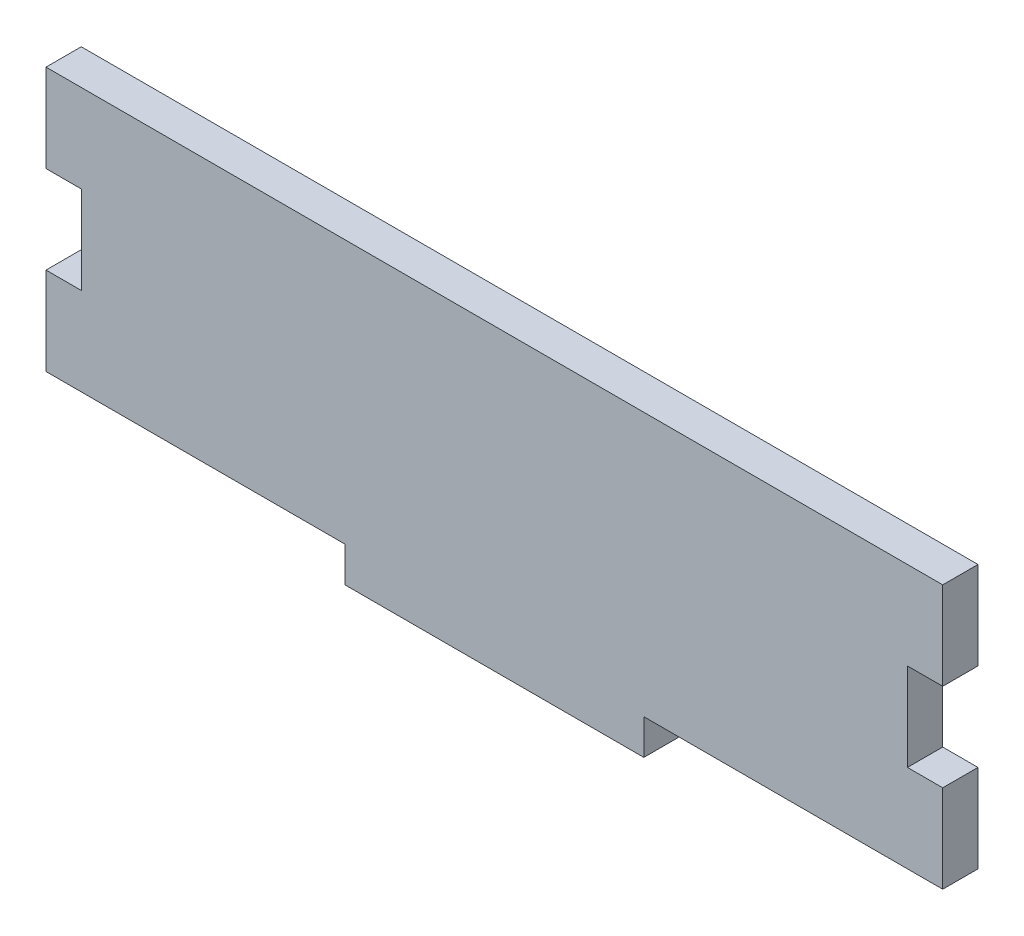
ISO-10303-21;
HEADER;
FILE_DESCRIPTION(('STEP AP214'),'2;1');
FILE_NAME('part.step','',(''),(''),'','','');
FILE_SCHEMA(('AUTOMOTIVE_DESIGN { 1 0 10303 214 1 1 1 1 }'));
ENDSEC;
DATA;
#1=APPLICATION_CONTEXT('core data for automotive mechanical design processes');
#2=APPLICATION_PROTOCOL_DEFINITION('international standard','automotive_design',2000,#1);
#3=PRODUCT_CONTEXT('',#1,'mechanical');
#4=PRODUCT('Part','Part','',(#3));
#5=PRODUCT_RELATED_PRODUCT_CATEGORY('part','',(#4));
#6=PRODUCT_DEFINITION_FORMATION('','',#4);
#7=PRODUCT_DEFINITION_CONTEXT('part definition',#1,'design');
#8=PRODUCT_DEFINITION('design','',#6,#7);
#9=PRODUCT_DEFINITION_SHAPE('','',#8);
#10=(LENGTH_UNIT() NAMED_UNIT(*) SI_UNIT(.MILLI.,.METRE.));
#11=(NAMED_UNIT(*) PLANE_ANGLE_UNIT() SI_UNIT($,.RADIAN.));
#12=(NAMED_UNIT(*) SI_UNIT($,.STERADIAN.) SOLID_ANGLE_UNIT());
#13=UNCERTAINTY_MEASURE_WITH_UNIT(LENGTH_MEASURE(1.E-05),#10,'distance_accuracy_value','');
#14=(GEOMETRIC_REPRESENTATION_CONTEXT(3) GLOBAL_UNCERTAINTY_ASSIGNED_CONTEXT((#13)) GLOBAL_UNIT_ASSIGNED_CONTEXT((#10,
#11,#12)) REPRESENTATION_CONTEXT('',''));
#15=CARTESIAN_POINT('',(0.,0.,0.));
#16=DIRECTION('',(0.,0.,1.));
#17=DIRECTION('',(1.,0.,0.));
#18=AXIS2_PLACEMENT_3D('',#15,#16,#17);
#19=CARTESIAN_POINT('',(-13.6707944709191,19.8635648334526,2.9972));
#20=DIRECTION('',(1.,0.,0.));
#21=DIRECTION('',(0.,0.,-1.));
#22=AXIS2_PLACEMENT_3D('',#19,#20,#21);
#23=PLANE('',#22);
#24=DIRECTION('',(0.,-1.,0.));
#25=VECTOR('',#24,1.);
#26=CARTESIAN_POINT('',(-13.6707944709191,19.8635648334526,0.));
#27=LINE('',#26,#25);
#28=CARTESIAN_POINT('',(-13.6707944709191,27.3311648334526,0.));
#29=VERTEX_POINT('',#28);
#30=CARTESIAN_POINT('',(-13.6707944709191,19.8635648334526,0.));
#31=VERTEX_POINT('',#30);
#32=EDGE_CURVE('E176',#29,#31,#27,.T.);
#33=ORIENTED_EDGE('',*,*,#32,.T.);
#34=DIRECTION('',(0.,0.,-1.));
#35=VECTOR('',#34,1.);
#36=CARTESIAN_POINT('',(-13.6707944709191,19.8635648334526,2.9972));
#37=LINE('',#36,#35);
#38=CARTESIAN_POINT('',(-13.6707944709191,19.8635648334526,2.9972));
#39=VERTEX_POINT('',#38);
#40=EDGE_CURVE('E40',#39,#31,#37,.T.);
#41=ORIENTED_EDGE('',*,*,#40,.F.);
#42=DIRECTION('',(0.,-1.,0.));
#43=VECTOR('',#42,1.);
#44=CARTESIAN_POINT('',(-13.6707944709191,19.8635648334526,2.9972));
#45=LINE('',#44,#43);
#46=CARTESIAN_POINT('',(-13.6707944709191,27.3311648334526,2.9972));
#47=VERTEX_POINT('',#46);
#48=EDGE_CURVE('E293',#47,#39,#45,.T.);
#49=ORIENTED_EDGE('',*,*,#48,.F.);
#50=DIRECTION('',(0.,0.,-1.));
#51=VECTOR('',#50,1.);
#52=CARTESIAN_POINT('',(-13.6707944709191,27.3311648334526,2.9972));
#53=LINE('',#52,#51);
#54=EDGE_CURVE('E11',#47,#29,#53,.T.);
#55=ORIENTED_EDGE('',*,*,#54,.T.);
#56=EDGE_LOOP('',(#33,#41,#49,#55));
#57=FACE_BOUND('',#56,.T.);
#58=ADVANCED_FACE('F32',(#57),#23,.F.);
#59=CARTESIAN_POINT('',(-13.6707944709191,19.8635648334526,2.9972));
#60=DIRECTION('',(0.,1.,0.));
#61=DIRECTION('',(0.,0.,1.));
#62=AXIS2_PLACEMENT_3D('',#59,#60,#61);
#63=PLANE('',#62);
#64=DIRECTION('',(1.,0.,0.));
#65=VECTOR('',#64,1.);
#66=CARTESIAN_POINT('',(-13.6707944709191,19.8635648334526,0.));
#67=LINE('',#66,#65);
#68=CARTESIAN_POINT('',(-10.6735944709191,19.8635648334526,0.));
#69=VERTEX_POINT('',#68);
#70=EDGE_CURVE('E178',#31,#69,#67,.T.);
#71=ORIENTED_EDGE('',*,*,#70,.T.);
#72=DIRECTION('',(0.,0.,-1.));
#73=VECTOR('',#72,1.);
#74=CARTESIAN_POINT('',(-10.6735944709191,19.8635648334526,2.9972));
#75=LINE('',#74,#73);
#76=CARTESIAN_POINT('',(-10.6735944709191,19.8635648334526,2.9972));
#77=VERTEX_POINT('',#76);
#78=EDGE_CURVE('E235',#77,#69,#75,.T.);
#79=ORIENTED_EDGE('',*,*,#78,.F.);
#80=DIRECTION('',(1.,0.,0.));
#81=VECTOR('',#80,1.);
#82=CARTESIAN_POINT('',(-13.6707944709191,19.8635648334526,2.9972));
#83=LINE('',#82,#81);
#84=EDGE_CURVE('E244',#39,#77,#83,.T.);
#85=ORIENTED_EDGE('',*,*,#84,.F.);
#86=ORIENTED_EDGE('',*,*,#40,.T.);
#87=EDGE_LOOP('',(#71,#79,#85,#86));
#88=FACE_BOUND('',#87,.T.);
#89=ADVANCED_FACE('F242',(#88),#63,.F.);
#90=CARTESIAN_POINT('',(-10.6735944709191,19.8635648334526,2.9972));
#91=DIRECTION('',(1.,0.,0.));
#92=DIRECTION('',(0.,0.,-1.));
#93=AXIS2_PLACEMENT_3D('',#90,#91,#92);
#94=PLANE('',#93);
#95=DIRECTION('',(0.,-1.,0.));
#96=VECTOR('',#95,1.);
#97=CARTESIAN_POINT('',(-10.6735944709191,19.8635648334526,0.));
#98=LINE('',#97,#96);
#99=CARTESIAN_POINT('',(-10.6735944709191,12.3959648334526,0.));
#100=VERTEX_POINT('',#99);
#101=EDGE_CURVE('E180',#69,#100,#98,.T.);
#102=ORIENTED_EDGE('',*,*,#101,.T.);
#103=DIRECTION('',(0.,0.,-1.));
#104=VECTOR('',#103,1.);
#105=CARTESIAN_POINT('',(-10.6735944709191,12.3959648334526,2.9972));
#106=LINE('',#105,#104);
#107=CARTESIAN_POINT('',(-10.6735944709191,12.3959648334526,2.9972));
#108=VERTEX_POINT('',#107);
#109=EDGE_CURVE('E232',#108,#100,#106,.T.);
#110=ORIENTED_EDGE('',*,*,#109,.F.);
#111=DIRECTION('',(0.,-1.,0.));
#112=VECTOR('',#111,1.);
#113=CARTESIAN_POINT('',(-10.6735944709191,19.8635648334526,2.9972));
#114=LINE('',#113,#112);
#115=EDGE_CURVE('E265',#77,#108,#114,.T.);
#116=ORIENTED_EDGE('',*,*,#115,.F.);
#117=ORIENTED_EDGE('',*,*,#78,.T.);
#118=EDGE_LOOP('',(#102,#110,#116,#117));
#119=FACE_BOUND('',#118,.T.);
#120=ADVANCED_FACE('F256',(#119),#94,.F.);
#121=CARTESIAN_POINT('',(-13.6707944709191,12.3959648334526,2.9972));
#122=DIRECTION('',(0.,-1.,0.));
#123=DIRECTION('',(0.,0.,-1.));
#124=AXIS2_PLACEMENT_3D('',#121,#122,#123);
#125=PLANE('',#124);
#126=DIRECTION('',(-1.,0.,0.));
#127=VECTOR('',#126,1.);
#128=CARTESIAN_POINT('',(-13.6707944709191,12.3959648334526,0.));
#129=LINE('',#128,#127);
#130=CARTESIAN_POINT('',(-13.6707944709191,12.3959648334526,0.));
#131=VERTEX_POINT('',#130);
#132=EDGE_CURVE('E182',#100,#131,#129,.T.);
#133=ORIENTED_EDGE('',*,*,#132,.T.);
#134=DIRECTION('',(0.,0.,-1.));
#135=VECTOR('',#134,1.);
#136=CARTESIAN_POINT('',(-13.6707944709191,12.3959648334526,2.9972));
#137=LINE('',#136,#135);
#138=CARTESIAN_POINT('',(-13.6707944709191,12.3959648334526,2.9972));
#139=VERTEX_POINT('',#138);
#140=EDGE_CURVE('E229',#139,#131,#137,.T.);
#141=ORIENTED_EDGE('',*,*,#140,.F.);
#142=DIRECTION('',(-1.,0.,0.));
#143=VECTOR('',#142,1.);
#144=CARTESIAN_POINT('',(-13.6707944709191,12.3959648334526,2.9972));
#145=LINE('',#144,#143);
#146=EDGE_CURVE('E262',#108,#139,#145,.T.);
#147=ORIENTED_EDGE('',*,*,#146,.F.);
#148=ORIENTED_EDGE('',*,*,#109,.T.);
#149=EDGE_LOOP('',(#133,#141,#147,#148));
#150=FACE_BOUND('',#149,.T.);
#151=ADVANCED_FACE('F260',(#150),#125,.F.);
#152=CARTESIAN_POINT('',(-13.6707944709191,4.92836483345263,2.9972));
#153=DIRECTION('',(1.,0.,0.));
#154=DIRECTION('',(0.,0.,-1.));
#155=AXIS2_PLACEMENT_3D('',#152,#153,#154);
#156=PLANE('',#155);
#157=DIRECTION('',(0.,-1.,0.));
#158=VECTOR('',#157,1.);
#159=CARTESIAN_POINT('',(-13.6707944709191,4.92836483345263,0.));
#160=LINE('',#159,#158);
#161=CARTESIAN_POINT('',(-13.6707944709191,4.92836483345263,0.));
#162=VERTEX_POINT('',#161);
#163=EDGE_CURVE('E184',#131,#162,#160,.T.);
#164=ORIENTED_EDGE('',*,*,#163,.T.);
#165=DIRECTION('',(0.,0.,-1.));
#166=VECTOR('',#165,1.);
#167=CARTESIAN_POINT('',(-13.6707944709191,4.92836483345263,2.9972));
#168=LINE('',#167,#166);
#169=CARTESIAN_POINT('',(-13.6707944709191,4.92836483345263,2.9972));
#170=VERTEX_POINT('',#169);
#171=EDGE_CURVE('E226',#170,#162,#168,.T.);
#172=ORIENTED_EDGE('',*,*,#171,.F.);
#173=DIRECTION('',(0.,-1.,0.));
#174=VECTOR('',#173,1.);
#175=CARTESIAN_POINT('',(-13.6707944709191,4.92836483345263,2.9972));
#176=LINE('',#175,#174);
#177=EDGE_CURVE('E264',#139,#170,#176,.T.);
#178=ORIENTED_EDGE('',*,*,#177,.F.);
#179=ORIENTED_EDGE('',*,*,#140,.T.);
#180=EDGE_LOOP('',(#164,#172,#178,#179));
#181=FACE_BOUND('',#180,.T.);
#182=ADVANCED_FACE('F307',(#181),#156,.F.);
#183=CARTESIAN_POINT('',(-13.6707944709191,4.92836483345263,2.9972));
#184=DIRECTION('',(0.,1.,0.));
#185=DIRECTION('',(0.,0.,1.));
#186=AXIS2_PLACEMENT_3D('',#183,#184,#185);
#187=PLANE('',#186);
#188=DIRECTION('',(1.,0.,0.));
#189=VECTOR('',#188,1.);
#190=CARTESIAN_POINT('',(-13.6707944709191,4.92836483345263,0.));
#191=LINE('',#190,#189);
#192=CARTESIAN_POINT('',(11.7292055290809,4.92836483345263,0.));
#193=VERTEX_POINT('',#192);
#194=EDGE_CURVE('E186',#162,#193,#191,.T.);
#195=ORIENTED_EDGE('',*,*,#194,.T.);
#196=DIRECTION('',(0.,0.,-1.));
#197=VECTOR('',#196,1.);
#198=CARTESIAN_POINT('',(11.7292055290809,4.92836483345263,2.9972));
#199=LINE('',#198,#197);
#200=CARTESIAN_POINT('',(11.7292055290809,4.92836483345263,2.9972));
#201=VERTEX_POINT('',#200);
#202=EDGE_CURVE('E223',#201,#193,#199,.T.);
#203=ORIENTED_EDGE('',*,*,#202,.F.);
#204=DIRECTION('',(1.,0.,0.));
#205=VECTOR('',#204,1.);
#206=CARTESIAN_POINT('',(-13.6707944709191,4.92836483345263,2.9972));
#207=LINE('',#206,#205);
#208=EDGE_CURVE('E267',#170,#201,#207,.T.);
#209=ORIENTED_EDGE('',*,*,#208,.F.);
#210=ORIENTED_EDGE('',*,*,#171,.T.);
#211=EDGE_LOOP('',(#195,#203,#209,#210));
#212=FACE_BOUND('',#211,.T.);
#213=ADVANCED_FACE('F310',(#212),#187,.F.);
#214=CARTESIAN_POINT('',(11.7292055290809,1.93116483345263,2.9972));
#215=DIRECTION('',(1.,0.,0.));
#216=DIRECTION('',(0.,0.,-1.));
#217=AXIS2_PLACEMENT_3D('',#214,#215,#216);
#218=PLANE('',#217);
#219=DIRECTION('',(0.,-1.,0.));
#220=VECTOR('',#219,1.);
#221=CARTESIAN_POINT('',(11.7292055290809,1.93116483345263,0.));
#222=LINE('',#221,#220);
#223=CARTESIAN_POINT('',(11.7292055290809,1.93116483345263,0.));
#224=VERTEX_POINT('',#223);
#225=EDGE_CURVE('E188',#193,#224,#222,.T.);
#226=ORIENTED_EDGE('',*,*,#225,.T.);
#227=DIRECTION('',(0.,0.,-1.));
#228=VECTOR('',#227,1.);
#229=CARTESIAN_POINT('',(11.7292055290809,1.93116483345263,2.9972));
#230=LINE('',#229,#228);
#231=CARTESIAN_POINT('',(11.7292055290809,1.93116483345263,2.9972));
#232=VERTEX_POINT('',#231);
#233=EDGE_CURVE('E220',#232,#224,#230,.T.);
#234=ORIENTED_EDGE('',*,*,#233,.F.);
#235=DIRECTION('',(0.,-1.,0.));
#236=VECTOR('',#235,1.);
#237=CARTESIAN_POINT('',(11.7292055290809,1.93116483345263,2.9972));
#238=LINE('',#237,#236);
#239=EDGE_CURVE('E273',#201,#232,#238,.T.);
#240=ORIENTED_EDGE('',*,*,#239,.F.);
#241=ORIENTED_EDGE('',*,*,#202,.T.);
#242=EDGE_LOOP('',(#226,#234,#240,#241));
#243=FACE_BOUND('',#242,.T.);
#244=ADVANCED_FACE('F314',(#243),#218,.F.);
#245=CARTESIAN_POINT('',(11.7292055290809,1.93116483345263,2.9972));
#246=DIRECTION('',(0.,1.,0.));
#247=DIRECTION('',(-1.,0.,0.));
#248=AXIS2_PLACEMENT_3D('',#245,#246,#247);
#249=PLANE('',#248);
#250=DIRECTION('',(1.,0.,0.));
#251=VECTOR('',#250,1.);
#252=CARTESIAN_POINT('',(11.7292055290809,1.93116483345263,0.));
#253=LINE('',#252,#251);
#254=CARTESIAN_POINT('',(37.1292055290809,1.93116483345263,0.));
#255=VERTEX_POINT('',#254);
#256=EDGE_CURVE('E190',#224,#255,#253,.T.);
#257=ORIENTED_EDGE('',*,*,#256,.T.);
#258=DIRECTION('',(0.,0.,-1.));
#259=VECTOR('',#258,1.);
#260=CARTESIAN_POINT('',(37.1292055290809,1.93116483345263,2.9972));
#261=LINE('',#260,#259);
#262=CARTESIAN_POINT('',(37.1292055290809,1.93116483345263,2.9972));
#263=VERTEX_POINT('',#262);
#264=EDGE_CURVE('E217',#263,#255,#261,.T.);
#265=ORIENTED_EDGE('',*,*,#264,.F.);
#266=DIRECTION('',(1.,0.,0.));
#267=VECTOR('',#266,1.);
#268=CARTESIAN_POINT('',(11.7292055290809,1.93116483345263,2.9972));
#269=LINE('',#268,#267);
#270=EDGE_CURVE('E275',#232,#263,#269,.T.);
#271=ORIENTED_EDGE('',*,*,#270,.F.);
#272=ORIENTED_EDGE('',*,*,#233,.T.);
#273=EDGE_LOOP('',(#257,#265,#271,#272));
#274=FACE_BOUND('',#273,.T.);
#275=ADVANCED_FACE('F318',(#274),#249,.F.);
#276=CARTESIAN_POINT('',(37.1292055290809,1.93116483345263,2.9972));
#277=DIRECTION('',(-1.,0.,0.));
#278=DIRECTION('',(0.,0.,1.));
#279=AXIS2_PLACEMENT_3D('',#276,#277,#278);
#280=PLANE('',#279);
#281=DIRECTION('',(0.,1.,0.));
#282=VECTOR('',#281,1.);
#283=CARTESIAN_POINT('',(37.1292055290809,1.93116483345263,0.));
#284=LINE('',#283,#282);
#285=CARTESIAN_POINT('',(37.1292055290809,4.92836483345263,0.));
#286=VERTEX_POINT('',#285);
#287=EDGE_CURVE('E192',#255,#286,#284,.T.);
#288=ORIENTED_EDGE('',*,*,#287,.T.);
#289=DIRECTION('',(0.,0.,-1.));
#290=VECTOR('',#289,1.);
#291=CARTESIAN_POINT('',(37.1292055290809,4.92836483345263,2.9972));
#292=LINE('',#291,#290);
#293=CARTESIAN_POINT('',(37.1292055290809,4.92836483345263,2.9972));
#294=VERTEX_POINT('',#293);
#295=EDGE_CURVE('E214',#294,#286,#292,.T.);
#296=ORIENTED_EDGE('',*,*,#295,.F.);
#297=DIRECTION('',(0.,1.,0.));
#298=VECTOR('',#297,1.);
#299=CARTESIAN_POINT('',(37.1292055290809,1.93116483345263,2.9972));
#300=LINE('',#299,#298);
#301=EDGE_CURVE('E277',#263,#294,#300,.T.);
#302=ORIENTED_EDGE('',*,*,#301,.F.);
#303=ORIENTED_EDGE('',*,*,#264,.T.);
#304=EDGE_LOOP('',(#288,#296,#302,#303));
#305=FACE_BOUND('',#304,.T.);
#306=ADVANCED_FACE('F322',(#305),#280,.F.);
#307=CARTESIAN_POINT('',(62.5292055290809,4.92836483345263,2.9972));
#308=DIRECTION('',(0.,1.,0.));
#309=DIRECTION('',(0.,0.,1.));
#310=AXIS2_PLACEMENT_3D('',#307,#308,#309);
#311=PLANE('',#310);
#312=DIRECTION('',(1.,0.,0.));
#313=VECTOR('',#312,1.);
#314=CARTESIAN_POINT('',(62.5292055290809,4.92836483345263,0.));
#315=LINE('',#314,#313);
#316=CARTESIAN_POINT('',(62.5292055290809,4.92836483345263,0.));
#317=VERTEX_POINT('',#316);
#318=EDGE_CURVE('E194',#286,#317,#315,.T.);
#319=ORIENTED_EDGE('',*,*,#318,.T.);
#320=DIRECTION('',(0.,0.,-1.));
#321=VECTOR('',#320,1.);
#322=CARTESIAN_POINT('',(62.5292055290809,4.92836483345263,2.9972));
#323=LINE('',#322,#321);
#324=CARTESIAN_POINT('',(62.5292055290809,4.92836483345263,2.9972));
#325=VERTEX_POINT('',#324);
#326=EDGE_CURVE('E211',#325,#317,#323,.T.);
#327=ORIENTED_EDGE('',*,*,#326,.F.);
#328=DIRECTION('',(1.,0.,0.));
#329=VECTOR('',#328,1.);
#330=CARTESIAN_POINT('',(62.5292055290809,4.92836483345263,2.9972));
#331=LINE('',#330,#329);
#332=EDGE_CURVE('E279',#294,#325,#331,.T.);
#333=ORIENTED_EDGE('',*,*,#332,.F.);
#334=ORIENTED_EDGE('',*,*,#295,.T.);
#335=EDGE_LOOP('',(#319,#327,#333,#334));
#336=FACE_BOUND('',#335,.T.);
#337=ADVANCED_FACE('F326',(#336),#311,.F.);
#338=CARTESIAN_POINT('',(62.5292055290809,4.92836483345263,2.9972));
#339=DIRECTION('',(-1.,0.,0.));
#340=DIRECTION('',(0.,0.,1.));
#341=AXIS2_PLACEMENT_3D('',#338,#339,#340);
#342=PLANE('',#341);
#343=DIRECTION('',(0.,1.,0.));
#344=VECTOR('',#343,1.);
#345=CARTESIAN_POINT('',(62.5292055290809,4.92836483345263,0.));
#346=LINE('',#345,#344);
#347=CARTESIAN_POINT('',(62.5292055290809,12.3959648334526,0.));
#348=VERTEX_POINT('',#347);
#349=EDGE_CURVE('E196',#317,#348,#346,.T.);
#350=ORIENTED_EDGE('',*,*,#349,.T.);
#351=DIRECTION('',(0.,0.,-1.));
#352=VECTOR('',#351,1.);
#353=CARTESIAN_POINT('',(62.5292055290809,12.3959648334526,2.9972));
#354=LINE('',#353,#352);
#355=CARTESIAN_POINT('',(62.5292055290809,12.3959648334526,2.9972));
#356=VERTEX_POINT('',#355);
#357=EDGE_CURVE('E208',#356,#348,#354,.T.);
#358=ORIENTED_EDGE('',*,*,#357,.F.);
#359=DIRECTION('',(0.,1.,0.));
#360=VECTOR('',#359,1.);
#361=CARTESIAN_POINT('',(62.5292055290809,4.92836483345263,2.9972));
#362=LINE('',#361,#360);
#363=EDGE_CURVE('E281',#325,#356,#362,.T.);
#364=ORIENTED_EDGE('',*,*,#363,.F.);
#365=ORIENTED_EDGE('',*,*,#326,.T.);
#366=EDGE_LOOP('',(#350,#358,#364,#365));
#367=FACE_BOUND('',#366,.T.);
#368=ADVANCED_FACE('F287',(#367),#342,.F.);
#369=CARTESIAN_POINT('',(62.5292055290809,12.3959648334526,2.9972));
#370=DIRECTION('',(0.,-1.,0.));
#371=DIRECTION('',(0.,0.,-1.));
#372=AXIS2_PLACEMENT_3D('',#369,#370,#371);
#373=PLANE('',#372);
#374=DIRECTION('',(-1.,0.,0.));
#375=VECTOR('',#374,1.);
#376=CARTESIAN_POINT('',(62.5292055290809,12.3959648334526,0.));
#377=LINE('',#376,#375);
#378=CARTESIAN_POINT('',(59.5320055290809,12.3959648334526,0.));
#379=VERTEX_POINT('',#378);
#380=EDGE_CURVE('E198',#348,#379,#377,.T.);
#381=ORIENTED_EDGE('',*,*,#380,.T.);
#382=DIRECTION('',(0.,0.,-1.));
#383=VECTOR('',#382,1.);
#384=CARTESIAN_POINT('',(59.5320055290809,12.3959648334526,2.9972));
#385=LINE('',#384,#383);
#386=CARTESIAN_POINT('',(59.5320055290809,12.3959648334526,2.9972));
#387=VERTEX_POINT('',#386);
#388=EDGE_CURVE('E165',#387,#379,#385,.T.);
#389=ORIENTED_EDGE('',*,*,#388,.F.);
#390=DIRECTION('',(-1.,0.,0.));
#391=VECTOR('',#390,1.);
#392=CARTESIAN_POINT('',(62.5292055290809,12.3959648334526,2.9972));
#393=LINE('',#392,#391);
#394=EDGE_CURVE('E156',#356,#387,#393,.T.);
#395=ORIENTED_EDGE('',*,*,#394,.F.);
#396=ORIENTED_EDGE('',*,*,#357,.T.);
#397=EDGE_LOOP('',(#381,#389,#395,#396));
#398=FACE_BOUND('',#397,.T.);
#399=ADVANCED_FACE('F291',(#398),#373,.F.);
#400=CARTESIAN_POINT('',(59.5320055290809,19.8635648334526,2.9972));
#401=DIRECTION('',(-1.,0.,0.));
#402=DIRECTION('',(0.,0.,1.));
#403=AXIS2_PLACEMENT_3D('',#400,#401,#402);
#404=PLANE('',#403);
#405=DIRECTION('',(0.,1.,0.));
#406=VECTOR('',#405,1.);
#407=CARTESIAN_POINT('',(59.5320055290809,19.8635648334526,0.));
#408=LINE('',#407,#406);
#409=CARTESIAN_POINT('',(59.5320055290809,19.8635648334526,0.));
#410=VERTEX_POINT('',#409);
#411=EDGE_CURVE('E164',#379,#410,#408,.T.);
#412=ORIENTED_EDGE('',*,*,#411,.T.);
#413=DIRECTION('',(0.,0.,-1.));
#414=VECTOR('',#413,1.);
#415=CARTESIAN_POINT('',(59.5320055290809,19.8635648334526,2.9972));
#416=LINE('',#415,#414);
#417=CARTESIAN_POINT('',(59.5320055290809,19.8635648334526,2.9972));
#418=VERTEX_POINT('',#417);
#419=EDGE_CURVE('E161',#418,#410,#416,.T.);
#420=ORIENTED_EDGE('',*,*,#419,.F.);
#421=DIRECTION('',(0.,1.,0.));
#422=VECTOR('',#421,1.);
#423=CARTESIAN_POINT('',(59.5320055290809,19.8635648334526,2.9972));
#424=LINE('',#423,#422);
#425=EDGE_CURVE('E150',#387,#418,#424,.T.);
#426=ORIENTED_EDGE('',*,*,#425,.F.);
#427=ORIENTED_EDGE('',*,*,#388,.T.);
#428=EDGE_LOOP('',(#412,#420,#426,#427));
#429=FACE_BOUND('',#428,.T.);
#430=ADVANCED_FACE('F162',(#429),#404,.F.);
#431=CARTESIAN_POINT('',(62.5292055290809,19.8635648334526,2.9972));
#432=DIRECTION('',(0.,1.,0.));
#433=DIRECTION('',(0.,0.,1.));
#434=AXIS2_PLACEMENT_3D('',#431,#432,#433);
#435=PLANE('',#434);
#436=DIRECTION('',(1.,0.,0.));
#437=VECTOR('',#436,1.);
#438=CARTESIAN_POINT('',(62.5292055290809,19.8635648334526,0.));
#439=LINE('',#438,#437);
#440=CARTESIAN_POINT('',(62.5292055290809,19.8635648334526,0.));
#441=VERTEX_POINT('',#440);
#442=EDGE_CURVE('E102',#410,#441,#439,.T.);
#443=ORIENTED_EDGE('',*,*,#442,.T.);
#444=DIRECTION('',(0.,0.,-1.));
#445=VECTOR('',#444,1.);
#446=CARTESIAN_POINT('',(62.5292055290809,19.8635648334526,2.9972));
#447=LINE('',#446,#445);
#448=CARTESIAN_POINT('',(62.5292055290809,19.8635648334526,2.9972));
#449=VERTEX_POINT('',#448);
#450=EDGE_CURVE('E166',#449,#441,#447,.T.);
#451=ORIENTED_EDGE('',*,*,#450,.F.);
#452=DIRECTION('',(1.,0.,0.));
#453=VECTOR('',#452,1.);
#454=CARTESIAN_POINT('',(62.5292055290809,19.8635648334526,2.9972));
#455=LINE('',#454,#453);
#456=EDGE_CURVE('E154',#418,#449,#455,.T.);
#457=ORIENTED_EDGE('',*,*,#456,.F.);
#458=ORIENTED_EDGE('',*,*,#419,.T.);
#459=EDGE_LOOP('',(#443,#451,#457,#458));
#460=FACE_BOUND('',#459,.T.);
#461=ADVANCED_FACE('F168',(#460),#435,.F.);
#462=CARTESIAN_POINT('',(62.5292055290809,19.8635648334526,2.9972));
#463=DIRECTION('',(-1.,0.,0.));
#464=DIRECTION('',(0.,0.,1.));
#465=AXIS2_PLACEMENT_3D('',#462,#463,#464);
#466=PLANE('',#465);
#467=DIRECTION('',(0.,1.,0.));
#468=VECTOR('',#467,1.);
#469=CARTESIAN_POINT('',(62.5292055290809,19.8635648334526,0.));
#470=LINE('',#469,#468);
#471=CARTESIAN_POINT('',(62.5292055290809,27.3311648334526,0.));
#472=VERTEX_POINT('',#471);
#473=EDGE_CURVE('E109',#441,#472,#470,.T.);
#474=ORIENTED_EDGE('',*,*,#473,.T.);
#475=DIRECTION('',(0.,0.,-1.));
#476=VECTOR('',#475,1.);
#477=CARTESIAN_POINT('',(62.5292055290809,27.3311648334526,2.9972));
#478=LINE('',#477,#476);
#479=CARTESIAN_POINT('',(62.5292055290809,27.3311648334526,2.9972));
#480=VERTEX_POINT('',#479);
#481=EDGE_CURVE('E172',#480,#472,#478,.T.);
#482=ORIENTED_EDGE('',*,*,#481,.F.);
#483=DIRECTION('',(0.,1.,0.));
#484=VECTOR('',#483,1.);
#485=CARTESIAN_POINT('',(62.5292055290809,19.8635648334526,2.9972));
#486=LINE('',#485,#484);
#487=EDGE_CURVE('E170',#449,#480,#486,.T.);
#488=ORIENTED_EDGE('',*,*,#487,.F.);
#489=ORIENTED_EDGE('',*,*,#450,.T.);
#490=EDGE_LOOP('',(#474,#482,#488,#489));
#491=FACE_BOUND('',#490,.T.);
#492=ADVANCED_FACE('F339',(#491),#466,.F.);
#493=CARTESIAN_POINT('',(32.0492055290809,27.3311648334526,2.9972));
#494=DIRECTION('',(0.,-1.,0.));
#495=DIRECTION('',(0.,0.,-1.));
#496=AXIS2_PLACEMENT_3D('',#493,#494,#495);
#497=PLANE('',#496);
#498=DIRECTION('',(-1.,0.,0.));
#499=VECTOR('',#498,1.);
#500=CARTESIAN_POINT('',(32.0492055290809,27.3311648334526,0.));
#501=LINE('',#500,#499);
#502=EDGE_CURVE('E203',#472,#29,#501,.T.);
#503=ORIENTED_EDGE('',*,*,#502,.T.);
#504=ORIENTED_EDGE('',*,*,#54,.F.);
#505=DIRECTION('',(-1.,0.,0.));
#506=VECTOR('',#505,1.);
#507=CARTESIAN_POINT('',(16.8092055290809,27.3311648334526,2.9972));
#508=LINE('',#507,#506);
#509=EDGE_CURVE('E48',#480,#47,#508,.T.);
#510=ORIENTED_EDGE('',*,*,#509,.F.);
#511=ORIENTED_EDGE('',*,*,#481,.T.);
#512=EDGE_LOOP('',(#503,#504,#510,#511));
#513=FACE_BOUND('',#512,.T.);
#514=ADVANCED_FACE('F292',(#513),#497,.F.);
#515=CARTESIAN_POINT('',(62.5292055290809,27.3311648334526,2.9972));
#516=DIRECTION('',(0.,0.,1.));
#517=DIRECTION('',(1.,0.,0.));
#518=AXIS2_PLACEMENT_3D('',#515,#516,#517);
#519=PLANE('',#518);
#520=ORIENTED_EDGE('',*,*,#509,.T.);
#521=ORIENTED_EDGE('',*,*,#48,.T.);
#522=ORIENTED_EDGE('',*,*,#84,.T.);
#523=ORIENTED_EDGE('',*,*,#115,.T.);
#524=ORIENTED_EDGE('',*,*,#146,.T.);
#525=ORIENTED_EDGE('',*,*,#177,.T.);
#526=ORIENTED_EDGE('',*,*,#208,.T.);
#527=ORIENTED_EDGE('',*,*,#239,.T.);
#528=ORIENTED_EDGE('',*,*,#270,.T.);
#529=ORIENTED_EDGE('',*,*,#301,.T.);
#530=ORIENTED_EDGE('',*,*,#332,.T.);
#531=ORIENTED_EDGE('',*,*,#363,.T.);
#532=ORIENTED_EDGE('',*,*,#394,.T.);
#533=ORIENTED_EDGE('',*,*,#425,.T.);
#534=ORIENTED_EDGE('',*,*,#456,.T.);
#535=ORIENTED_EDGE('',*,*,#487,.T.);
#536=EDGE_LOOP('',(#520,#521,#522,#523,#524,#525,#526,#527,#528,#529,#530,#531,#532,#533,#534,#535));
#537=FACE_BOUND('',#536,.T.);
#538=ADVANCED_FACE('F152',(#537),#519,.T.);
#539=CARTESIAN_POINT('',(62.5292055290809,27.3311648334526,0.));
#540=DIRECTION('',(0.,0.,1.));
#541=DIRECTION('',(1.,0.,0.));
#542=AXIS2_PLACEMENT_3D('',#539,#540,#541);
#543=PLANE('',#542);
#544=ORIENTED_EDGE('',*,*,#32,.F.);
#545=ORIENTED_EDGE('',*,*,#502,.F.);
#546=ORIENTED_EDGE('',*,*,#473,.F.);
#547=ORIENTED_EDGE('',*,*,#442,.F.);
#548=ORIENTED_EDGE('',*,*,#411,.F.);
#549=ORIENTED_EDGE('',*,*,#380,.F.);
#550=ORIENTED_EDGE('',*,*,#349,.F.);
#551=ORIENTED_EDGE('',*,*,#318,.F.);
#552=ORIENTED_EDGE('',*,*,#287,.F.);
#553=ORIENTED_EDGE('',*,*,#256,.F.);
#554=ORIENTED_EDGE('',*,*,#225,.F.);
#555=ORIENTED_EDGE('',*,*,#194,.F.);
#556=ORIENTED_EDGE('',*,*,#163,.F.);
#557=ORIENTED_EDGE('',*,*,#132,.F.);
#558=ORIENTED_EDGE('',*,*,#101,.F.);
#559=ORIENTED_EDGE('',*,*,#70,.F.);
#560=EDGE_LOOP('',(#544,#545,#546,#547,#548,#549,#550,#551,#552,#553,#554,#555,#556,#557,#558,#559));
#561=FACE_BOUND('',#560,.T.);
#562=ADVANCED_FACE('F250',(#561),#543,.F.);
#563=CLOSED_SHELL('',(#58,#89,#120,#151,#182,#213,#244,#275,#306,#337,#368,#399,#430,#461,#492,
#514,#538,#562));
#564=MANIFOLD_SOLID_BREP('B2',#563);
#565=ADVANCED_BREP_SHAPE_REPRESENTATION('',(#18,#564),#14);
#566=SHAPE_DEFINITION_REPRESENTATION(#9,#565);
ENDSEC;
END-ISO-10303-21;
